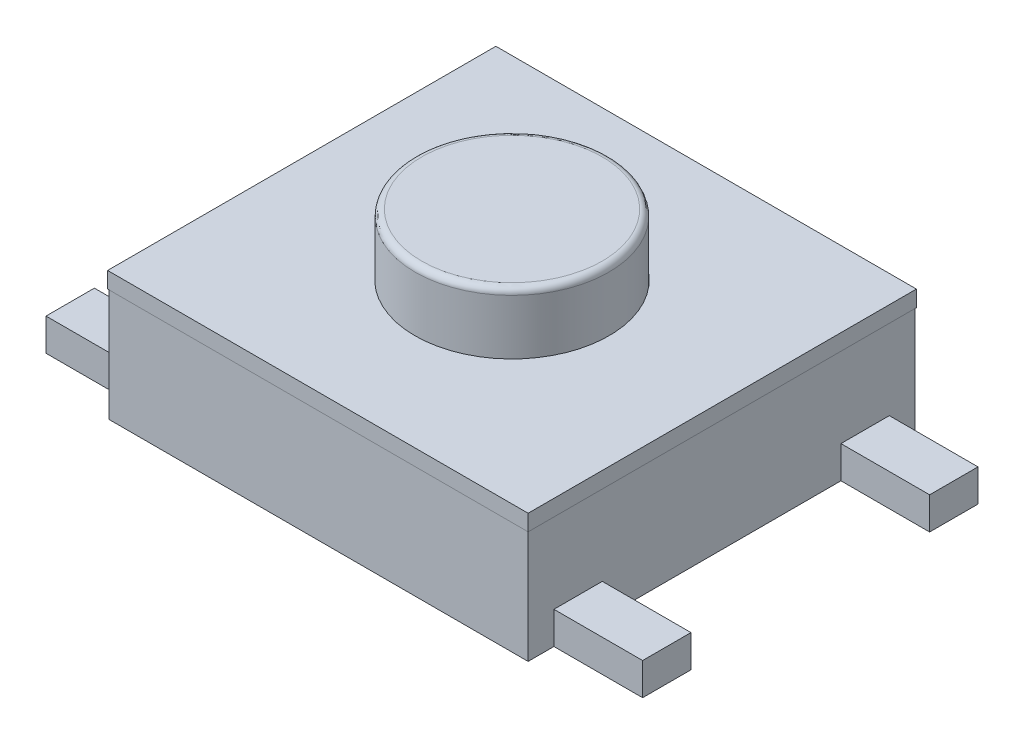
ISO-10303-21;
HEADER;
FILE_DESCRIPTION(('STEP AP214'),'2;1');
FILE_NAME('part.step','',(''),(''),'','','');
FILE_SCHEMA(('AUTOMOTIVE_DESIGN { 1 0 10303 214 1 1 1 1 }'));
ENDSEC;
DATA;
#1=APPLICATION_CONTEXT('core data for automotive mechanical design processes');
#2=APPLICATION_PROTOCOL_DEFINITION('international standard','automotive_design',2000,#1);
#3=PRODUCT_CONTEXT('',#1,'mechanical');
#4=PRODUCT('Part','Part','',(#3));
#5=PRODUCT_RELATED_PRODUCT_CATEGORY('part','',(#4));
#6=PRODUCT_DEFINITION_FORMATION('','',#4);
#7=PRODUCT_DEFINITION_CONTEXT('part definition',#1,'design');
#8=PRODUCT_DEFINITION('design','',#6,#7);
#9=PRODUCT_DEFINITION_SHAPE('','',#8);
#10=(LENGTH_UNIT() NAMED_UNIT(*) SI_UNIT(.MILLI.,.METRE.));
#11=(NAMED_UNIT(*) PLANE_ANGLE_UNIT() SI_UNIT($,.RADIAN.));
#12=(NAMED_UNIT(*) SI_UNIT($,.STERADIAN.) SOLID_ANGLE_UNIT());
#13=UNCERTAINTY_MEASURE_WITH_UNIT(LENGTH_MEASURE(1.E-05),#10,'distance_accuracy_value','');
#14=(GEOMETRIC_REPRESENTATION_CONTEXT(3) GLOBAL_UNCERTAINTY_ASSIGNED_CONTEXT((#13)) GLOBAL_UNIT_ASSIGNED_CONTEXT((#10,
#11,#12)) REPRESENTATION_CONTEXT('',''));
#15=CARTESIAN_POINT('',(0.,0.,0.));
#16=DIRECTION('',(0.,0.,1.));
#17=DIRECTION('',(1.,0.,0.));
#18=AXIS2_PLACEMENT_3D('',#15,#16,#17);
#19=CARTESIAN_POINT('',(-3.25,1.75,-3.));
#20=DIRECTION('',(1.,0.,0.));
#21=DIRECTION('',(0.,0.,-1.));
#22=AXIS2_PLACEMENT_3D('',#19,#20,#21);
#23=PLANE('',#22);
#24=DIRECTION('',(0.,0.,1.));
#25=VECTOR('',#24,1.);
#26=CARTESIAN_POINT('',(-3.25,0.,-3.));
#27=LINE('',#26,#25);
#28=CARTESIAN_POINT('',(-3.25,0.,-1.85));
#29=VERTEX_POINT('',#28);
#30=CARTESIAN_POINT('',(-3.25,0.,-0.375));
#31=VERTEX_POINT('',#30);
#32=EDGE_CURVE('E425',#29,#31,#27,.T.);
#33=ORIENTED_EDGE('',*,*,#32,.T.);
#34=DIRECTION('',(0.,-1.,0.));
#35=VECTOR('',#34,1.);
#36=CARTESIAN_POINT('',(-3.25,0.5,-0.375));
#37=LINE('',#36,#35);
#38=CARTESIAN_POINT('',(-3.25,0.5,-0.375));
#39=VERTEX_POINT('',#38);
#40=EDGE_CURVE('E52',#39,#31,#37,.T.);
#41=ORIENTED_EDGE('',*,*,#40,.F.);
#42=DIRECTION('',(0.,0.,1.));
#43=VECTOR('',#42,1.);
#44=CARTESIAN_POINT('',(-3.25,0.5,0.375));
#45=LINE('',#44,#43);
#46=CARTESIAN_POINT('',(-3.25,0.5,0.375));
#47=VERTEX_POINT('',#46);
#48=EDGE_CURVE('E47',#39,#47,#45,.T.);
#49=ORIENTED_EDGE('',*,*,#48,.T.);
#50=DIRECTION('',(0.,-1.,0.));
#51=VECTOR('',#50,1.);
#52=CARTESIAN_POINT('',(-3.25,0.5,0.375));
#53=LINE('',#52,#51);
#54=CARTESIAN_POINT('',(-3.25,0.,0.375));
#55=VERTEX_POINT('',#54);
#56=EDGE_CURVE('E228',#47,#55,#53,.T.);
#57=ORIENTED_EDGE('',*,*,#56,.T.);
#58=CARTESIAN_POINT('',(-3.25,0.,1.85));
#59=VERTEX_POINT('',#58);
#60=EDGE_CURVE('E426',#55,#59,#27,.T.);
#61=ORIENTED_EDGE('',*,*,#60,.T.);
#62=DIRECTION('',(0.,-1.,0.));
#63=VECTOR('',#62,1.);
#64=CARTESIAN_POINT('',(-3.25,0.5,1.85));
#65=LINE('',#64,#63);
#66=CARTESIAN_POINT('',(-3.25,0.5,1.85));
#67=VERTEX_POINT('',#66);
#68=EDGE_CURVE('E276',#67,#59,#65,.T.);
#69=ORIENTED_EDGE('',*,*,#68,.F.);
#70=DIRECTION('',(0.,0.,1.));
#71=VECTOR('',#70,1.);
#72=CARTESIAN_POINT('',(-3.25,0.5,2.6));
#73=LINE('',#72,#71);
#74=CARTESIAN_POINT('',(-3.25,0.5,2.6));
#75=VERTEX_POINT('',#74);
#76=EDGE_CURVE('E262',#67,#75,#73,.T.);
#77=ORIENTED_EDGE('',*,*,#76,.T.);
#78=DIRECTION('',(0.,-1.,0.));
#79=VECTOR('',#78,1.);
#80=CARTESIAN_POINT('',(-3.25,0.5,2.6));
#81=LINE('',#80,#79);
#82=CARTESIAN_POINT('',(-3.25,0.,2.6));
#83=VERTEX_POINT('',#82);
#84=EDGE_CURVE('E272',#75,#83,#81,.T.);
#85=ORIENTED_EDGE('',*,*,#84,.T.);
#86=CARTESIAN_POINT('',(-3.25,0.,3.));
#87=VERTEX_POINT('',#86);
#88=EDGE_CURVE('E407',#83,#87,#27,.T.);
#89=ORIENTED_EDGE('',*,*,#88,.T.);
#90=DIRECTION('',(0.,-1.,0.));
#91=VECTOR('',#90,1.);
#92=CARTESIAN_POINT('',(-3.25,1.75,3.));
#93=LINE('',#92,#91);
#94=CARTESIAN_POINT('',(-3.25,1.75,3.));
#95=VERTEX_POINT('',#94);
#96=EDGE_CURVE('E441',#95,#87,#93,.T.);
#97=ORIENTED_EDGE('',*,*,#96,.F.);
#98=DIRECTION('',(0.,0.,1.));
#99=VECTOR('',#98,1.);
#100=CARTESIAN_POINT('',(-3.25,1.75,-3.));
#101=LINE('',#100,#99);
#102=CARTESIAN_POINT('',(-3.25,1.75,-3.));
#103=VERTEX_POINT('',#102);
#104=EDGE_CURVE('E408',#103,#95,#101,.T.);
#105=ORIENTED_EDGE('',*,*,#104,.F.);
#106=DIRECTION('',(0.,-1.,0.));
#107=VECTOR('',#106,1.);
#108=CARTESIAN_POINT('',(-3.25,1.75,-3.));
#109=LINE('',#108,#107);
#110=CARTESIAN_POINT('',(-3.25,0.,-3.));
#111=VERTEX_POINT('',#110);
#112=EDGE_CURVE('E421',#103,#111,#109,.T.);
#113=ORIENTED_EDGE('',*,*,#112,.T.);
#114=CARTESIAN_POINT('',(-3.25,0.,-2.6));
#115=VERTEX_POINT('',#114);
#116=EDGE_CURVE('E422',#111,#115,#27,.T.);
#117=ORIENTED_EDGE('',*,*,#116,.T.);
#118=DIRECTION('',(0.,-1.,0.));
#119=VECTOR('',#118,1.);
#120=CARTESIAN_POINT('',(-3.25,0.5,-2.6));
#121=LINE('',#120,#119);
#122=CARTESIAN_POINT('',(-3.25,0.5,-2.6));
#123=VERTEX_POINT('',#122);
#124=EDGE_CURVE('E302',#123,#115,#121,.T.);
#125=ORIENTED_EDGE('',*,*,#124,.F.);
#126=DIRECTION('',(0.,0.,1.));
#127=VECTOR('',#126,1.);
#128=CARTESIAN_POINT('',(-3.25,0.5,-2.6));
#129=LINE('',#128,#127);
#130=CARTESIAN_POINT('',(-3.25,0.5,-1.85));
#131=VERTEX_POINT('',#130);
#132=EDGE_CURVE('E282',#123,#131,#129,.T.);
#133=ORIENTED_EDGE('',*,*,#132,.T.);
#134=DIRECTION('',(0.,-1.,0.));
#135=VECTOR('',#134,1.);
#136=CARTESIAN_POINT('',(-3.25,0.5,-1.85));
#137=LINE('',#136,#135);
#138=EDGE_CURVE('E294',#131,#29,#137,.T.);
#139=ORIENTED_EDGE('',*,*,#138,.T.);
#140=EDGE_LOOP('',(#33,#41,#49,#57,#61,#69,#77,#85,#89,#97,#105,#113,#117,#125,#133,#139));
#141=FACE_BOUND('',#140,.T.);
#142=ADVANCED_FACE('F32',(#141),#23,.F.);
#143=CARTESIAN_POINT('',(-3.25,1.75,3.));
#144=DIRECTION('',(0.,0.,-1.));
#145=DIRECTION('',(-1.,0.,0.));
#146=AXIS2_PLACEMENT_3D('',#143,#144,#145);
#147=PLANE('',#146);
#148=DIRECTION('',(1.,0.,0.));
#149=VECTOR('',#148,1.);
#150=CARTESIAN_POINT('',(-3.25,0.,3.));
#151=LINE('',#150,#149);
#152=CARTESIAN_POINT('',(3.25,0.,3.));
#153=VERTEX_POINT('',#152);
#154=EDGE_CURVE('E424',#87,#153,#151,.T.);
#155=ORIENTED_EDGE('',*,*,#154,.T.);
#156=DIRECTION('',(0.,-1.,0.));
#157=VECTOR('',#156,1.);
#158=CARTESIAN_POINT('',(3.25,1.75,3.));
#159=LINE('',#158,#157);
#160=CARTESIAN_POINT('',(3.25,1.75,3.));
#161=VERTEX_POINT('',#160);
#162=EDGE_CURVE('E438',#161,#153,#159,.T.);
#163=ORIENTED_EDGE('',*,*,#162,.F.);
#164=DIRECTION('',(1.,0.,0.));
#165=VECTOR('',#164,1.);
#166=CARTESIAN_POINT('',(-3.25,1.75,3.));
#167=LINE('',#166,#165);
#168=EDGE_CURVE('E411',#95,#161,#167,.T.);
#169=ORIENTED_EDGE('',*,*,#168,.F.);
#170=ORIENTED_EDGE('',*,*,#96,.T.);
#171=EDGE_LOOP('',(#155,#163,#169,#170));
#172=FACE_BOUND('',#171,.T.);
#173=ADVANCED_FACE('F465',(#172),#147,.F.);
#174=CARTESIAN_POINT('',(3.25,1.75,-3.));
#175=DIRECTION('',(-1.,0.,0.));
#176=DIRECTION('',(0.,0.,1.));
#177=AXIS2_PLACEMENT_3D('',#174,#175,#176);
#178=PLANE('',#177);
#179=DIRECTION('',(0.,0.,-1.));
#180=VECTOR('',#179,1.);
#181=CARTESIAN_POINT('',(3.25,0.5,-2.6));
#182=LINE('',#181,#180);
#183=CARTESIAN_POINT('',(3.25,0.5,-1.85));
#184=VERTEX_POINT('',#183);
#185=CARTESIAN_POINT('',(3.25,0.5,-2.6));
#186=VERTEX_POINT('',#185);
#187=EDGE_CURVE('E322',#184,#186,#182,.T.);
#188=ORIENTED_EDGE('',*,*,#187,.T.);
#189=DIRECTION('',(0.,-1.,0.));
#190=VECTOR('',#189,1.);
#191=CARTESIAN_POINT('',(3.25,0.5,-2.6));
#192=LINE('',#191,#190);
#193=CARTESIAN_POINT('',(3.25,0.,-2.6));
#194=VERTEX_POINT('',#193);
#195=EDGE_CURVE('E332',#186,#194,#192,.T.);
#196=ORIENTED_EDGE('',*,*,#195,.T.);
#197=DIRECTION('',(0.,0.,-1.));
#198=VECTOR('',#197,1.);
#199=CARTESIAN_POINT('',(3.25,0.,-3.));
#200=LINE('',#199,#198);
#201=CARTESIAN_POINT('',(3.25,0.,-3.));
#202=VERTEX_POINT('',#201);
#203=EDGE_CURVE('E428',#194,#202,#200,.T.);
#204=ORIENTED_EDGE('',*,*,#203,.T.);
#205=DIRECTION('',(0.,-1.,0.));
#206=VECTOR('',#205,1.);
#207=CARTESIAN_POINT('',(3.25,1.75,-3.));
#208=LINE('',#207,#206);
#209=CARTESIAN_POINT('',(3.25,1.75,-3.));
#210=VERTEX_POINT('',#209);
#211=EDGE_CURVE('E435',#210,#202,#208,.T.);
#212=ORIENTED_EDGE('',*,*,#211,.F.);
#213=DIRECTION('',(0.,0.,-1.));
#214=VECTOR('',#213,1.);
#215=CARTESIAN_POINT('',(3.25,1.75,-3.));
#216=LINE('',#215,#214);
#217=EDGE_CURVE('E415',#161,#210,#216,.T.);
#218=ORIENTED_EDGE('',*,*,#217,.F.);
#219=ORIENTED_EDGE('',*,*,#162,.T.);
#220=CARTESIAN_POINT('',(3.25,0.,2.6));
#221=VERTEX_POINT('',#220);
#222=EDGE_CURVE('E429',#153,#221,#200,.T.);
#223=ORIENTED_EDGE('',*,*,#222,.T.);
#224=DIRECTION('',(0.,-1.,0.));
#225=VECTOR('',#224,1.);
#226=CARTESIAN_POINT('',(3.25,0.5,2.6));
#227=LINE('',#226,#225);
#228=CARTESIAN_POINT('',(3.25,0.5,2.6));
#229=VERTEX_POINT('',#228);
#230=EDGE_CURVE('E362',#229,#221,#227,.T.);
#231=ORIENTED_EDGE('',*,*,#230,.F.);
#232=DIRECTION('',(0.,0.,-1.));
#233=VECTOR('',#232,1.);
#234=CARTESIAN_POINT('',(3.25,0.5,2.6));
#235=LINE('',#234,#233);
#236=CARTESIAN_POINT('',(3.25,0.5,1.85));
#237=VERTEX_POINT('',#236);
#238=EDGE_CURVE('E342',#229,#237,#235,.T.);
#239=ORIENTED_EDGE('',*,*,#238,.T.);
#240=DIRECTION('',(0.,-1.,0.));
#241=VECTOR('',#240,1.);
#242=CARTESIAN_POINT('',(3.25,0.5,1.85));
#243=LINE('',#242,#241);
#244=CARTESIAN_POINT('',(3.25,0.,1.85));
#245=VERTEX_POINT('',#244);
#246=EDGE_CURVE('E354',#237,#245,#243,.T.);
#247=ORIENTED_EDGE('',*,*,#246,.T.);
#248=CARTESIAN_POINT('',(3.25,0.,-1.85));
#249=VERTEX_POINT('',#248);
#250=EDGE_CURVE('E431',#245,#249,#200,.T.);
#251=ORIENTED_EDGE('',*,*,#250,.T.);
#252=DIRECTION('',(0.,-1.,0.));
#253=VECTOR('',#252,1.);
#254=CARTESIAN_POINT('',(3.25,0.5,-1.85));
#255=LINE('',#254,#253);
#256=EDGE_CURVE('E336',#184,#249,#255,.T.);
#257=ORIENTED_EDGE('',*,*,#256,.F.);
#258=EDGE_LOOP('',(#188,#196,#204,#212,#218,#219,#223,#231,#239,#247,#251,#257));
#259=FACE_BOUND('',#258,.T.);
#260=ADVANCED_FACE('F469',(#259),#178,.F.);
#261=CARTESIAN_POINT('',(-3.25,1.75,-3.));
#262=DIRECTION('',(0.,0.,1.));
#263=DIRECTION('',(1.,0.,0.));
#264=AXIS2_PLACEMENT_3D('',#261,#262,#263);
#265=PLANE('',#264);
#266=DIRECTION('',(-1.,0.,0.));
#267=VECTOR('',#266,1.);
#268=CARTESIAN_POINT('',(-3.25,0.,-3.));
#269=LINE('',#268,#267);
#270=EDGE_CURVE('E412',#202,#111,#269,.T.);
#271=ORIENTED_EDGE('',*,*,#270,.T.);
#272=ORIENTED_EDGE('',*,*,#112,.F.);
#273=DIRECTION('',(-1.,0.,0.));
#274=VECTOR('',#273,1.);
#275=CARTESIAN_POINT('',(-3.25,1.75,-3.));
#276=LINE('',#275,#274);
#277=EDGE_CURVE('E418',#210,#103,#276,.T.);
#278=ORIENTED_EDGE('',*,*,#277,.F.);
#279=ORIENTED_EDGE('',*,*,#211,.T.);
#280=EDGE_LOOP('',(#271,#272,#278,#279));
#281=FACE_BOUND('',#280,.T.);
#282=ADVANCED_FACE('F475',(#281),#265,.F.);
#283=CARTESIAN_POINT('',(0.,0.,0.));
#284=DIRECTION('',(0.,1.,0.));
#285=DIRECTION('',(0.,0.,1.));
#286=AXIS2_PLACEMENT_3D('',#283,#284,#285);
#287=PLANE('',#286);
#288=ORIENTED_EDGE('',*,*,#116,.F.);
#289=ORIENTED_EDGE('',*,*,#270,.F.);
#290=ORIENTED_EDGE('',*,*,#203,.F.);
#291=DIRECTION('',(1.,0.,0.));
#292=VECTOR('',#291,1.);
#293=CARTESIAN_POINT('',(3.25,0.,-2.6));
#294=LINE('',#293,#292);
#295=CARTESIAN_POINT('',(4.625,0.,-2.6));
#296=VERTEX_POINT('',#295);
#297=EDGE_CURVE('E305',#194,#296,#294,.T.);
#298=ORIENTED_EDGE('',*,*,#297,.T.);
#299=DIRECTION('',(0.,0.,1.));
#300=VECTOR('',#299,1.);
#301=CARTESIAN_POINT('',(4.625,0.,-2.6));
#302=LINE('',#301,#300);
#303=CARTESIAN_POINT('',(4.625,0.,-1.85));
#304=VERTEX_POINT('',#303);
#305=EDGE_CURVE('E327',#296,#304,#302,.T.);
#306=ORIENTED_EDGE('',*,*,#305,.T.);
#307=DIRECTION('',(-1.,0.,0.));
#308=VECTOR('',#307,1.);
#309=CARTESIAN_POINT('',(3.25,0.,-1.85));
#310=LINE('',#309,#308);
#311=EDGE_CURVE('E316',#304,#249,#310,.T.);
#312=ORIENTED_EDGE('',*,*,#311,.T.);
#313=ORIENTED_EDGE('',*,*,#250,.F.);
#314=DIRECTION('',(1.,0.,0.));
#315=VECTOR('',#314,1.);
#316=CARTESIAN_POINT('',(3.25,0.,1.85));
#317=LINE('',#316,#315);
#318=CARTESIAN_POINT('',(4.625,0.,1.85));
#319=VERTEX_POINT('',#318);
#320=EDGE_CURVE('E335',#245,#319,#317,.T.);
#321=ORIENTED_EDGE('',*,*,#320,.T.);
#322=DIRECTION('',(0.,0.,1.));
#323=VECTOR('',#322,1.);
#324=CARTESIAN_POINT('',(4.625,0.,2.6));
#325=LINE('',#324,#323);
#326=CARTESIAN_POINT('',(4.625,0.,2.6));
#327=VERTEX_POINT('',#326);
#328=EDGE_CURVE('E357',#319,#327,#325,.T.);
#329=ORIENTED_EDGE('',*,*,#328,.T.);
#330=DIRECTION('',(-1.,0.,0.));
#331=VECTOR('',#330,1.);
#332=CARTESIAN_POINT('',(3.25,0.,2.6));
#333=LINE('',#332,#331);
#334=EDGE_CURVE('E345',#327,#221,#333,.T.);
#335=ORIENTED_EDGE('',*,*,#334,.T.);
#336=ORIENTED_EDGE('',*,*,#222,.F.);
#337=ORIENTED_EDGE('',*,*,#154,.F.);
#338=ORIENTED_EDGE('',*,*,#88,.F.);
#339=DIRECTION('',(-1.,0.,0.));
#340=VECTOR('',#339,1.);
#341=CARTESIAN_POINT('',(-3.25,0.,2.6));
#342=LINE('',#341,#340);
#343=CARTESIAN_POINT('',(-4.625,0.,2.6));
#344=VERTEX_POINT('',#343);
#345=EDGE_CURVE('E249',#83,#344,#342,.T.);
#346=ORIENTED_EDGE('',*,*,#345,.T.);
#347=DIRECTION('',(0.,0.,-1.));
#348=VECTOR('',#347,1.);
#349=CARTESIAN_POINT('',(-4.625,0.,2.6));
#350=LINE('',#349,#348);
#351=CARTESIAN_POINT('',(-4.625,0.,1.85));
#352=VERTEX_POINT('',#351);
#353=EDGE_CURVE('E267',#344,#352,#350,.T.);
#354=ORIENTED_EDGE('',*,*,#353,.T.);
#355=DIRECTION('',(1.,0.,0.));
#356=VECTOR('',#355,1.);
#357=CARTESIAN_POINT('',(-3.25,0.,1.85));
#358=LINE('',#357,#356);
#359=EDGE_CURVE('E256',#352,#59,#358,.T.);
#360=ORIENTED_EDGE('',*,*,#359,.T.);
#361=ORIENTED_EDGE('',*,*,#60,.F.);
#362=DIRECTION('',(-1.,0.,0.));
#363=VECTOR('',#362,1.);
#364=CARTESIAN_POINT('',(-3.25,0.,0.375));
#365=LINE('',#364,#363);
#366=CARTESIAN_POINT('',(-4.625,0.,0.375));
#367=VERTEX_POINT('',#366);
#368=EDGE_CURVE('E243',#55,#367,#365,.T.);
#369=ORIENTED_EDGE('',*,*,#368,.T.);
#370=DIRECTION('',(0.,0.,-1.));
#371=VECTOR('',#370,1.);
#372=CARTESIAN_POINT('',(-4.625,0.,0.375));
#373=LINE('',#372,#371);
#374=CARTESIAN_POINT('',(-4.625,0.,-0.375));
#375=VERTEX_POINT('',#374);
#376=EDGE_CURVE('E222',#367,#375,#373,.T.);
#377=ORIENTED_EDGE('',*,*,#376,.T.);
#378=DIRECTION('',(1.,0.,0.));
#379=VECTOR('',#378,1.);
#380=CARTESIAN_POINT('',(-3.25,0.,-0.375));
#381=LINE('',#380,#379);
#382=EDGE_CURVE('E239',#375,#31,#381,.T.);
#383=ORIENTED_EDGE('',*,*,#382,.T.);
#384=ORIENTED_EDGE('',*,*,#32,.F.);
#385=DIRECTION('',(-1.,0.,0.));
#386=VECTOR('',#385,1.);
#387=CARTESIAN_POINT('',(-3.25,0.,-1.85));
#388=LINE('',#387,#386);
#389=CARTESIAN_POINT('',(-4.625,0.,-1.85));
#390=VERTEX_POINT('',#389);
#391=EDGE_CURVE('E275',#29,#390,#388,.T.);
#392=ORIENTED_EDGE('',*,*,#391,.T.);
#393=DIRECTION('',(0.,0.,-1.));
#394=VECTOR('',#393,1.);
#395=CARTESIAN_POINT('',(-4.625,0.,-2.6));
#396=LINE('',#395,#394);
#397=CARTESIAN_POINT('',(-4.625,0.,-2.6));
#398=VERTEX_POINT('',#397);
#399=EDGE_CURVE('E297',#390,#398,#396,.T.);
#400=ORIENTED_EDGE('',*,*,#399,.T.);
#401=DIRECTION('',(1.,0.,0.));
#402=VECTOR('',#401,1.);
#403=CARTESIAN_POINT('',(-3.25,0.,-2.6));
#404=LINE('',#403,#402);
#405=EDGE_CURVE('E285',#398,#115,#404,.T.);
#406=ORIENTED_EDGE('',*,*,#405,.T.);
#407=EDGE_LOOP('',(#288,#289,#290,#298,#306,#312,#313,#321,#329,#335,#336,#337,#338,#346,#354,
#360,#361,#369,#377,#383,#384,#392,#400,#406));
#408=FACE_BOUND('',#407,.T.);
#409=ADVANCED_FACE('F479',(#408),#287,.F.);
#410=CARTESIAN_POINT('',(0.,1.75,0.));
#411=DIRECTION('',(0.,1.,0.));
#412=DIRECTION('',(0.,0.,1.));
#413=AXIS2_PLACEMENT_3D('',#410,#411,#412);
#414=PLANE('',#413);
#415=DIRECTION('',(-1.,0.,0.));
#416=VECTOR('',#415,1.);
#417=CARTESIAN_POINT('',(3.26,1.75,-3.01));
#418=LINE('',#417,#416);
#419=CARTESIAN_POINT('',(3.26,1.75,-3.01));
#420=VERTEX_POINT('',#419);
#421=CARTESIAN_POINT('',(-3.26,1.75,-3.01));
#422=VERTEX_POINT('',#421);
#423=EDGE_CURVE('E377',#420,#422,#418,.T.);
#424=ORIENTED_EDGE('',*,*,#423,.F.);
#425=DIRECTION('',(0.,0.,-1.));
#426=VECTOR('',#425,1.);
#427=CARTESIAN_POINT('',(3.26,1.75,3.01));
#428=LINE('',#427,#426);
#429=CARTESIAN_POINT('',(3.26,1.75,3.01));
#430=VERTEX_POINT('',#429);
#431=EDGE_CURVE('E382',#430,#420,#428,.T.);
#432=ORIENTED_EDGE('',*,*,#431,.F.);
#433=DIRECTION('',(1.,0.,0.));
#434=VECTOR('',#433,1.);
#435=CARTESIAN_POINT('',(-3.26,1.75,3.01));
#436=LINE('',#435,#434);
#437=CARTESIAN_POINT('',(-3.26,1.75,3.01));
#438=VERTEX_POINT('',#437);
#439=EDGE_CURVE('E393',#438,#430,#436,.T.);
#440=ORIENTED_EDGE('',*,*,#439,.F.);
#441=DIRECTION('',(0.,0.,1.));
#442=VECTOR('',#441,1.);
#443=CARTESIAN_POINT('',(-3.26,1.75,-3.01));
#444=LINE('',#443,#442);
#445=EDGE_CURVE('E391',#422,#438,#444,.T.);
#446=ORIENTED_EDGE('',*,*,#445,.F.);
#447=EDGE_LOOP('',(#424,#432,#440,#446));
#448=FACE_BOUND('',#447,.T.);
#449=ORIENTED_EDGE('',*,*,#277,.T.);
#450=ORIENTED_EDGE('',*,*,#104,.T.);
#451=ORIENTED_EDGE('',*,*,#168,.T.);
#452=ORIENTED_EDGE('',*,*,#217,.T.);
#453=EDGE_LOOP('',(#449,#450,#451,#452));
#454=FACE_BOUND('',#453,.T.);
#455=ADVANCED_FACE('F483',(#448,#454),#414,.F.);
#456=CARTESIAN_POINT('',(0.,2.,0.));
#457=DIRECTION('',(0.,1.,0.));
#458=DIRECTION('',(0.,0.,1.));
#459=AXIS2_PLACEMENT_3D('',#456,#457,#458);
#460=PLANE('',#459);
#461=DIRECTION('',(-1.,0.,0.));
#462=VECTOR('',#461,1.);
#463=CARTESIAN_POINT('',(3.26,2.,-3.01));
#464=LINE('',#463,#462);
#465=CARTESIAN_POINT('',(3.26,2.,-3.01));
#466=VERTEX_POINT('',#465);
#467=CARTESIAN_POINT('',(-3.26,2.,-3.01));
#468=VERTEX_POINT('',#467);
#469=EDGE_CURVE('E378',#466,#468,#464,.T.);
#470=ORIENTED_EDGE('',*,*,#469,.T.);
#471=DIRECTION('',(0.,0.,1.));
#472=VECTOR('',#471,1.);
#473=CARTESIAN_POINT('',(-3.26,2.,-3.01));
#474=LINE('',#473,#472);
#475=CARTESIAN_POINT('',(-3.26,2.,3.01));
#476=VERTEX_POINT('',#475);
#477=EDGE_CURVE('E381',#468,#476,#474,.T.);
#478=ORIENTED_EDGE('',*,*,#477,.T.);
#479=DIRECTION('',(1.,0.,0.));
#480=VECTOR('',#479,1.);
#481=CARTESIAN_POINT('',(-3.26,2.,3.01));
#482=LINE('',#481,#480);
#483=CARTESIAN_POINT('',(3.26,2.,3.01));
#484=VERTEX_POINT('',#483);
#485=EDGE_CURVE('E384',#476,#484,#482,.T.);
#486=ORIENTED_EDGE('',*,*,#485,.T.);
#487=DIRECTION('',(0.,0.,-1.));
#488=VECTOR('',#487,1.);
#489=CARTESIAN_POINT('',(3.26,2.,3.01));
#490=LINE('',#489,#488);
#491=EDGE_CURVE('E386',#484,#466,#490,.T.);
#492=ORIENTED_EDGE('',*,*,#491,.T.);
#493=EDGE_LOOP('',(#470,#478,#486,#492));
#494=FACE_BOUND('',#493,.T.);
#495=CARTESIAN_POINT('',(0.,2.,0.));
#496=DIRECTION('',(0.,1.,0.));
#497=DIRECTION('',(0.,0.,1.));
#498=AXIS2_PLACEMENT_3D('',#495,#496,#497);
#499=CIRCLE('',#498,1.505);
#500=CARTESIAN_POINT('',(0.,2.,1.505));
#501=VERTEX_POINT('',#500);
#502=EDGE_CURVE('E374',#501,#501,#499,.T.);
#503=ORIENTED_EDGE('',*,*,#502,.F.);
#504=EDGE_LOOP('',(#503));
#505=FACE_BOUND('',#504,.T.);
#506=ADVANCED_FACE('F494',(#494,#505),#460,.T.);
#507=CARTESIAN_POINT('',(3.26,2.,-3.01));
#508=DIRECTION('',(0.,0.,1.));
#509=DIRECTION('',(1.,0.,0.));
#510=AXIS2_PLACEMENT_3D('',#507,#508,#509);
#511=PLANE('',#510);
#512=ORIENTED_EDGE('',*,*,#423,.T.);
#513=DIRECTION('',(0.,-1.,0.));
#514=VECTOR('',#513,1.);
#515=CARTESIAN_POINT('',(-3.26,2.,-3.01));
#516=LINE('',#515,#514);
#517=EDGE_CURVE('E404',#468,#422,#516,.T.);
#518=ORIENTED_EDGE('',*,*,#517,.F.);
#519=ORIENTED_EDGE('',*,*,#469,.F.);
#520=DIRECTION('',(0.,-1.,0.));
#521=VECTOR('',#520,1.);
#522=CARTESIAN_POINT('',(3.26,2.,-3.01));
#523=LINE('',#522,#521);
#524=EDGE_CURVE('E388',#466,#420,#523,.T.);
#525=ORIENTED_EDGE('',*,*,#524,.T.);
#526=EDGE_LOOP('',(#512,#518,#519,#525));
#527=FACE_BOUND('',#526,.T.);
#528=ADVANCED_FACE('F490',(#527),#511,.F.);
#529=CARTESIAN_POINT('',(-3.26,2.,-3.01));
#530=DIRECTION('',(1.,0.,0.));
#531=DIRECTION('',(0.,0.,-1.));
#532=AXIS2_PLACEMENT_3D('',#529,#530,#531);
#533=PLANE('',#532);
#534=ORIENTED_EDGE('',*,*,#445,.T.);
#535=DIRECTION('',(0.,-1.,0.));
#536=VECTOR('',#535,1.);
#537=CARTESIAN_POINT('',(-3.26,2.,3.01));
#538=LINE('',#537,#536);
#539=EDGE_CURVE('E401',#476,#438,#538,.T.);
#540=ORIENTED_EDGE('',*,*,#539,.F.);
#541=ORIENTED_EDGE('',*,*,#477,.F.);
#542=ORIENTED_EDGE('',*,*,#517,.T.);
#543=EDGE_LOOP('',(#534,#540,#541,#542));
#544=FACE_BOUND('',#543,.T.);
#545=ADVANCED_FACE('F493',(#544),#533,.F.);
#546=CARTESIAN_POINT('',(-3.26,2.,3.01));
#547=DIRECTION('',(0.,0.,-1.));
#548=DIRECTION('',(-1.,0.,0.));
#549=AXIS2_PLACEMENT_3D('',#546,#547,#548);
#550=PLANE('',#549);
#551=ORIENTED_EDGE('',*,*,#439,.T.);
#552=DIRECTION('',(0.,-1.,0.));
#553=VECTOR('',#552,1.);
#554=CARTESIAN_POINT('',(3.26,2.,3.01));
#555=LINE('',#554,#553);
#556=EDGE_CURVE('E398',#484,#430,#555,.T.);
#557=ORIENTED_EDGE('',*,*,#556,.F.);
#558=ORIENTED_EDGE('',*,*,#485,.F.);
#559=ORIENTED_EDGE('',*,*,#539,.T.);
#560=EDGE_LOOP('',(#551,#557,#558,#559));
#561=FACE_BOUND('',#560,.T.);
#562=ADVANCED_FACE('F498',(#561),#550,.F.);
#563=CARTESIAN_POINT('',(3.26,2.,3.01));
#564=DIRECTION('',(-1.,0.,0.));
#565=DIRECTION('',(0.,0.,1.));
#566=AXIS2_PLACEMENT_3D('',#563,#564,#565);
#567=PLANE('',#566);
#568=ORIENTED_EDGE('',*,*,#431,.T.);
#569=ORIENTED_EDGE('',*,*,#524,.F.);
#570=ORIENTED_EDGE('',*,*,#491,.F.);
#571=ORIENTED_EDGE('',*,*,#556,.T.);
#572=EDGE_LOOP('',(#568,#569,#570,#571));
#573=FACE_BOUND('',#572,.T.);
#574=ADVANCED_FACE('F502',(#573),#567,.F.);
#575=CARTESIAN_POINT('',(0.,2.,0.));
#576=DIRECTION('',(0.,-1.,0.));
#577=DIRECTION('',(0.,0.,-1.));
#578=AXIS2_PLACEMENT_3D('',#575,#576,#577);
#579=CYLINDRICAL_SURFACE('',#578,1.505);
#580=ORIENTED_EDGE('',*,*,#502,.T.);
#581=EDGE_LOOP('',(#580));
#582=FACE_BOUND('',#581,.T.);
#583=CARTESIAN_POINT('',(0.,1.75,0.));
#584=DIRECTION('',(0.,1.,0.));
#585=DIRECTION('',(0.,0.,1.));
#586=AXIS2_PLACEMENT_3D('',#583,#584,#585);
#587=CIRCLE('',#586,1.505);
#588=CARTESIAN_POINT('',(0.,1.75,1.505));
#589=VERTEX_POINT('',#588);
#590=EDGE_CURVE('E444',#589,#589,#587,.F.);
#591=ORIENTED_EDGE('',*,*,#590,.T.);
#592=EDGE_LOOP('',(#591));
#593=FACE_BOUND('',#592,.T.);
#594=ADVANCED_FACE('F488',(#582,#593),#579,.F.);
#595=CARTESIAN_POINT('',(0.,1.75,0.));
#596=DIRECTION('',(0.,1.,0.));
#597=DIRECTION('',(0.,0.,1.));
#598=AXIS2_PLACEMENT_3D('',#595,#596,#597);
#599=PLANE('',#598);
#600=CARTESIAN_POINT('',(0.,1.75,0.));
#601=DIRECTION('',(0.,1.,0.));
#602=DIRECTION('',(0.,0.,1.));
#603=AXIS2_PLACEMENT_3D('',#600,#601,#602);
#604=CIRCLE('',#603,1.5);
#605=CARTESIAN_POINT('',(0.,1.75,1.5));
#606=VERTEX_POINT('',#605);
#607=EDGE_CURVE('E365',#606,#606,#604,.T.);
#608=ORIENTED_EDGE('',*,*,#607,.F.);
#609=EDGE_LOOP('',(#608));
#610=FACE_BOUND('',#609,.T.);
#611=ORIENTED_EDGE('',*,*,#590,.F.);
#612=EDGE_LOOP('',(#611));
#613=FACE_BOUND('',#612,.T.);
#614=ADVANCED_FACE('F485',(#610,#613),#599,.T.);
#615=CARTESIAN_POINT('',(0.,2.95,0.));
#616=DIRECTION('',(0.,-1.,0.));
#617=DIRECTION('',(0.,0.,-1.));
#618=AXIS2_PLACEMENT_3D('',#615,#616,#617);
#619=CYLINDRICAL_SURFACE('',#618,1.5);
#620=CARTESIAN_POINT('',(0.,2.85,0.));
#621=DIRECTION('',(0.,1.,0.));
#622=DIRECTION('',(0.,0.,1.));
#623=AXIS2_PLACEMENT_3D('',#620,#621,#622);
#624=CIRCLE('',#623,1.5);
#625=CARTESIAN_POINT('',(0.,2.85,1.5));
#626=VERTEX_POINT('',#625);
#627=EDGE_CURVE('E11',#626,#626,#624,.F.);
#628=ORIENTED_EDGE('',*,*,#627,.T.);
#629=EDGE_LOOP('',(#628));
#630=FACE_BOUND('',#629,.T.);
#631=ORIENTED_EDGE('',*,*,#607,.T.);
#632=EDGE_LOOP('',(#631));
#633=FACE_BOUND('',#632,.T.);
#634=ADVANCED_FACE('F461',(#630,#633),#619,.T.);
#635=CARTESIAN_POINT('',(0.,2.95,0.));
#636=DIRECTION('',(0.,1.,0.));
#637=DIRECTION('',(0.,0.,1.));
#638=AXIS2_PLACEMENT_3D('',#635,#636,#637);
#639=PLANE('',#638);
#640=CARTESIAN_POINT('',(0.,2.95,0.));
#641=DIRECTION('',(0.,1.,0.));
#642=DIRECTION('',(0.,0.,1.));
#643=AXIS2_PLACEMENT_3D('',#640,#641,#642);
#644=CIRCLE('',#643,1.4);
#645=CARTESIAN_POINT('',(0.,2.95,1.4));
#646=VERTEX_POINT('',#645);
#647=EDGE_CURVE('E40',#646,#646,#644,.T.);
#648=ORIENTED_EDGE('',*,*,#647,.T.);
#649=EDGE_LOOP('',(#648));
#650=FACE_BOUND('',#649,.T.);
#651=ADVANCED_FACE('F449',(#650),#639,.T.);
#652=CARTESIAN_POINT('',(0.,2.85,0.));
#653=DIRECTION('',(0.,1.,0.));
#654=DIRECTION('',(0.,0.,1.));
#655=AXIS2_PLACEMENT_3D('',#652,#653,#654);
#656=TOROIDAL_SURFACE('',#655,1.4,0.1);
#657=ORIENTED_EDGE('',*,*,#627,.F.);
#658=EDGE_LOOP('',(#657));
#659=FACE_BOUND('',#658,.T.);
#660=ORIENTED_EDGE('',*,*,#647,.F.);
#661=EDGE_LOOP('',(#660));
#662=FACE_BOUND('',#661,.T.);
#663=ADVANCED_FACE('F34',(#659,#662),#656,.T.);
#664=CARTESIAN_POINT('',(3.25,0.5,2.6));
#665=DIRECTION('',(0.,0.,1.));
#666=DIRECTION('',(1.,0.,0.));
#667=AXIS2_PLACEMENT_3D('',#664,#665,#666);
#668=PLANE('',#667);
#669=ORIENTED_EDGE('',*,*,#334,.F.);
#670=DIRECTION('',(0.,-1.,0.));
#671=VECTOR('',#670,1.);
#672=CARTESIAN_POINT('',(4.625,0.5,2.6));
#673=LINE('',#672,#671);
#674=CARTESIAN_POINT('',(4.625,0.5,2.6));
#675=VERTEX_POINT('',#674);
#676=EDGE_CURVE('E366',#675,#327,#673,.T.);
#677=ORIENTED_EDGE('',*,*,#676,.F.);
#678=DIRECTION('',(-1.,0.,0.));
#679=VECTOR('',#678,1.);
#680=CARTESIAN_POINT('',(3.25,0.5,2.6));
#681=LINE('',#680,#679);
#682=EDGE_CURVE('E351',#675,#229,#681,.T.);
#683=ORIENTED_EDGE('',*,*,#682,.T.);
#684=ORIENTED_EDGE('',*,*,#230,.T.);
#685=EDGE_LOOP('',(#669,#677,#683,#684));
#686=FACE_BOUND('',#685,.T.);
#687=ADVANCED_FACE('F452',(#686),#668,.T.);
#688=CARTESIAN_POINT('',(4.625,0.5,2.6));
#689=DIRECTION('',(1.,0.,0.));
#690=DIRECTION('',(0.,0.,-1.));
#691=AXIS2_PLACEMENT_3D('',#688,#689,#690);
#692=PLANE('',#691);
#693=ORIENTED_EDGE('',*,*,#328,.F.);
#694=DIRECTION('',(0.,-1.,0.));
#695=VECTOR('',#694,1.);
#696=CARTESIAN_POINT('',(4.625,0.5,1.85));
#697=LINE('',#696,#695);
#698=CARTESIAN_POINT('',(4.625,0.5,1.85));
#699=VERTEX_POINT('',#698);
#700=EDGE_CURVE('E368',#699,#319,#697,.T.);
#701=ORIENTED_EDGE('',*,*,#700,.F.);
#702=DIRECTION('',(0.,0.,1.));
#703=VECTOR('',#702,1.);
#704=CARTESIAN_POINT('',(4.625,0.5,2.6));
#705=LINE('',#704,#703);
#706=EDGE_CURVE('E348',#699,#675,#705,.T.);
#707=ORIENTED_EDGE('',*,*,#706,.T.);
#708=ORIENTED_EDGE('',*,*,#676,.T.);
#709=EDGE_LOOP('',(#693,#701,#707,#708));
#710=FACE_BOUND('',#709,.T.);
#711=ADVANCED_FACE('F458',(#710),#692,.T.);
#712=CARTESIAN_POINT('',(3.25,0.5,1.85));
#713=DIRECTION('',(0.,0.,-1.));
#714=DIRECTION('',(-1.,0.,0.));
#715=AXIS2_PLACEMENT_3D('',#712,#713,#714);
#716=PLANE('',#715);
#717=ORIENTED_EDGE('',*,*,#320,.F.);
#718=ORIENTED_EDGE('',*,*,#246,.F.);
#719=DIRECTION('',(1.,0.,0.));
#720=VECTOR('',#719,1.);
#721=CARTESIAN_POINT('',(3.25,0.5,1.85));
#722=LINE('',#721,#720);
#723=EDGE_CURVE('E344',#237,#699,#722,.T.);
#724=ORIENTED_EDGE('',*,*,#723,.T.);
#725=ORIENTED_EDGE('',*,*,#700,.T.);
#726=EDGE_LOOP('',(#717,#718,#724,#725));
#727=FACE_BOUND('',#726,.T.);
#728=ADVANCED_FACE('F519',(#727),#716,.T.);
#729=CARTESIAN_POINT('',(0.,0.5,0.));
#730=DIRECTION('',(0.,-1.,0.));
#731=DIRECTION('',(0.,0.,-1.));
#732=AXIS2_PLACEMENT_3D('',#729,#730,#731);
#733=PLANE('',#732);
#734=ORIENTED_EDGE('',*,*,#238,.F.);
#735=ORIENTED_EDGE('',*,*,#682,.F.);
#736=ORIENTED_EDGE('',*,*,#706,.F.);
#737=ORIENTED_EDGE('',*,*,#723,.F.);
#738=EDGE_LOOP('',(#734,#735,#736,#737));
#739=FACE_BOUND('',#738,.T.);
#740=ADVANCED_FACE('F522',(#739),#733,.F.);
#741=CARTESIAN_POINT('',(3.25,0.5,-2.6));
#742=DIRECTION('',(0.,0.,-1.));
#743=DIRECTION('',(-1.,0.,0.));
#744=AXIS2_PLACEMENT_3D('',#741,#742,#743);
#745=PLANE('',#744);
#746=ORIENTED_EDGE('',*,*,#297,.F.);
#747=ORIENTED_EDGE('',*,*,#195,.F.);
#748=DIRECTION('',(1.,0.,0.));
#749=VECTOR('',#748,1.);
#750=CARTESIAN_POINT('',(3.25,0.5,-2.6));
#751=LINE('',#750,#749);
#752=CARTESIAN_POINT('',(4.625,0.5,-2.6));
#753=VERTEX_POINT('',#752);
#754=EDGE_CURVE('E312',#186,#753,#751,.T.);
#755=ORIENTED_EDGE('',*,*,#754,.T.);
#756=DIRECTION('',(0.,-1.,0.));
#757=VECTOR('',#756,1.);
#758=CARTESIAN_POINT('',(4.625,0.5,-2.6));
#759=LINE('',#758,#757);
#760=EDGE_CURVE('E324',#753,#296,#759,.T.);
#761=ORIENTED_EDGE('',*,*,#760,.T.);
#762=EDGE_LOOP('',(#746,#747,#755,#761));
#763=FACE_BOUND('',#762,.T.);
#764=ADVANCED_FACE('F529',(#763),#745,.T.);
#765=CARTESIAN_POINT('',(3.25,0.5,-1.85));
#766=DIRECTION('',(0.,0.,1.));
#767=DIRECTION('',(1.,0.,0.));
#768=AXIS2_PLACEMENT_3D('',#765,#766,#767);
#769=PLANE('',#768);
#770=ORIENTED_EDGE('',*,*,#311,.F.);
#771=DIRECTION('',(0.,-1.,0.));
#772=VECTOR('',#771,1.);
#773=CARTESIAN_POINT('',(4.625,0.5,-1.85));
#774=LINE('',#773,#772);
#775=CARTESIAN_POINT('',(4.625,0.5,-1.85));
#776=VERTEX_POINT('',#775);
#777=EDGE_CURVE('E339',#776,#304,#774,.T.);
#778=ORIENTED_EDGE('',*,*,#777,.F.);
#779=DIRECTION('',(-1.,0.,0.));
#780=VECTOR('',#779,1.);
#781=CARTESIAN_POINT('',(3.25,0.5,-1.85));
#782=LINE('',#781,#780);
#783=EDGE_CURVE('E319',#776,#184,#782,.T.);
#784=ORIENTED_EDGE('',*,*,#783,.T.);
#785=ORIENTED_EDGE('',*,*,#256,.T.);
#786=EDGE_LOOP('',(#770,#778,#784,#785));
#787=FACE_BOUND('',#786,.T.);
#788=ADVANCED_FACE('F533',(#787),#769,.T.);
#789=CARTESIAN_POINT('',(4.625,0.5,-2.6));
#790=DIRECTION('',(1.,0.,0.));
#791=DIRECTION('',(0.,0.,-1.));
#792=AXIS2_PLACEMENT_3D('',#789,#790,#791);
#793=PLANE('',#792);
#794=ORIENTED_EDGE('',*,*,#305,.F.);
#795=ORIENTED_EDGE('',*,*,#760,.F.);
#796=DIRECTION('',(0.,0.,1.));
#797=VECTOR('',#796,1.);
#798=CARTESIAN_POINT('',(4.625,0.5,-2.6));
#799=LINE('',#798,#797);
#800=EDGE_CURVE('E315',#753,#776,#799,.T.);
#801=ORIENTED_EDGE('',*,*,#800,.T.);
#802=ORIENTED_EDGE('',*,*,#777,.T.);
#803=EDGE_LOOP('',(#794,#795,#801,#802));
#804=FACE_BOUND('',#803,.T.);
#805=ADVANCED_FACE('F535',(#804),#793,.T.);
#806=CARTESIAN_POINT('',(0.,0.5,0.));
#807=DIRECTION('',(0.,-1.,0.));
#808=DIRECTION('',(0.,0.,-1.));
#809=AXIS2_PLACEMENT_3D('',#806,#807,#808);
#810=PLANE('',#809);
#811=ORIENTED_EDGE('',*,*,#754,.F.);
#812=ORIENTED_EDGE('',*,*,#187,.F.);
#813=ORIENTED_EDGE('',*,*,#783,.F.);
#814=ORIENTED_EDGE('',*,*,#800,.F.);
#815=EDGE_LOOP('',(#811,#812,#813,#814));
#816=FACE_BOUND('',#815,.T.);
#817=ADVANCED_FACE('F538',(#816),#810,.F.);
#818=CARTESIAN_POINT('',(-3.25,0.5,-2.6));
#819=DIRECTION('',(0.,0.,-1.));
#820=DIRECTION('',(-1.,0.,0.));
#821=AXIS2_PLACEMENT_3D('',#818,#819,#820);
#822=PLANE('',#821);
#823=ORIENTED_EDGE('',*,*,#405,.F.);
#824=DIRECTION('',(0.,-1.,0.));
#825=VECTOR('',#824,1.);
#826=CARTESIAN_POINT('',(-4.625,0.5,-2.6));
#827=LINE('',#826,#825);
#828=CARTESIAN_POINT('',(-4.625,0.5,-2.6));
#829=VERTEX_POINT('',#828);
#830=EDGE_CURVE('E306',#829,#398,#827,.T.);
#831=ORIENTED_EDGE('',*,*,#830,.F.);
#832=DIRECTION('',(1.,0.,0.));
#833=VECTOR('',#832,1.);
#834=CARTESIAN_POINT('',(-3.25,0.5,-2.6));
#835=LINE('',#834,#833);
#836=EDGE_CURVE('E291',#829,#123,#835,.T.);
#837=ORIENTED_EDGE('',*,*,#836,.T.);
#838=ORIENTED_EDGE('',*,*,#124,.T.);
#839=EDGE_LOOP('',(#823,#831,#837,#838));
#840=FACE_BOUND('',#839,.T.);
#841=ADVANCED_FACE('F545',(#840),#822,.T.);
#842=CARTESIAN_POINT('',(-4.625,0.5,-2.6));
#843=DIRECTION('',(-1.,0.,0.));
#844=DIRECTION('',(0.,0.,1.));
#845=AXIS2_PLACEMENT_3D('',#842,#843,#844);
#846=PLANE('',#845);
#847=ORIENTED_EDGE('',*,*,#399,.F.);
#848=DIRECTION('',(0.,-1.,0.));
#849=VECTOR('',#848,1.);
#850=CARTESIAN_POINT('',(-4.625,0.5,-1.85));
#851=LINE('',#850,#849);
#852=CARTESIAN_POINT('',(-4.625,0.5,-1.85));
#853=VERTEX_POINT('',#852);
#854=EDGE_CURVE('E308',#853,#390,#851,.T.);
#855=ORIENTED_EDGE('',*,*,#854,.F.);
#856=DIRECTION('',(0.,0.,-1.));
#857=VECTOR('',#856,1.);
#858=CARTESIAN_POINT('',(-4.625,0.5,-2.6));
#859=LINE('',#858,#857);
#860=EDGE_CURVE('E288',#853,#829,#859,.T.);
#861=ORIENTED_EDGE('',*,*,#860,.T.);
#862=ORIENTED_EDGE('',*,*,#830,.T.);
#863=EDGE_LOOP('',(#847,#855,#861,#862));
#864=FACE_BOUND('',#863,.T.);
#865=ADVANCED_FACE('F551',(#864),#846,.T.);
#866=CARTESIAN_POINT('',(-3.25,0.5,-1.85));
#867=DIRECTION('',(0.,0.,1.));
#868=DIRECTION('',(1.,0.,0.));
#869=AXIS2_PLACEMENT_3D('',#866,#867,#868);
#870=PLANE('',#869);
#871=ORIENTED_EDGE('',*,*,#391,.F.);
#872=ORIENTED_EDGE('',*,*,#138,.F.);
#873=DIRECTION('',(-1.,0.,0.));
#874=VECTOR('',#873,1.);
#875=CARTESIAN_POINT('',(-3.25,0.5,-1.85));
#876=LINE('',#875,#874);
#877=EDGE_CURVE('E284',#131,#853,#876,.T.);
#878=ORIENTED_EDGE('',*,*,#877,.T.);
#879=ORIENTED_EDGE('',*,*,#854,.T.);
#880=EDGE_LOOP('',(#871,#872,#878,#879));
#881=FACE_BOUND('',#880,.T.);
#882=ADVANCED_FACE('F547',(#881),#870,.T.);
#883=CARTESIAN_POINT('',(0.,0.5,0.));
#884=DIRECTION('',(0.,-1.,0.));
#885=DIRECTION('',(0.,0.,-1.));
#886=AXIS2_PLACEMENT_3D('',#883,#884,#885);
#887=PLANE('',#886);
#888=ORIENTED_EDGE('',*,*,#132,.F.);
#889=ORIENTED_EDGE('',*,*,#836,.F.);
#890=ORIENTED_EDGE('',*,*,#860,.F.);
#891=ORIENTED_EDGE('',*,*,#877,.F.);
#892=EDGE_LOOP('',(#888,#889,#890,#891));
#893=FACE_BOUND('',#892,.T.);
#894=ADVANCED_FACE('F550',(#893),#887,.F.);
#895=CARTESIAN_POINT('',(-3.25,0.5,2.6));
#896=DIRECTION('',(0.,0.,1.));
#897=DIRECTION('',(1.,0.,0.));
#898=AXIS2_PLACEMENT_3D('',#895,#896,#897);
#899=PLANE('',#898);
#900=ORIENTED_EDGE('',*,*,#345,.F.);
#901=ORIENTED_EDGE('',*,*,#84,.F.);
#902=DIRECTION('',(-1.,0.,0.));
#903=VECTOR('',#902,1.);
#904=CARTESIAN_POINT('',(-3.25,0.5,2.6));
#905=LINE('',#904,#903);
#906=CARTESIAN_POINT('',(-4.625,0.5,2.6));
#907=VERTEX_POINT('',#906);
#908=EDGE_CURVE('E252',#75,#907,#905,.T.);
#909=ORIENTED_EDGE('',*,*,#908,.T.);
#910=DIRECTION('',(0.,-1.,0.));
#911=VECTOR('',#910,1.);
#912=CARTESIAN_POINT('',(-4.625,0.5,2.6));
#913=LINE('',#912,#911);
#914=EDGE_CURVE('E264',#907,#344,#913,.T.);
#915=ORIENTED_EDGE('',*,*,#914,.T.);
#916=EDGE_LOOP('',(#900,#901,#909,#915));
#917=FACE_BOUND('',#916,.T.);
#918=ADVANCED_FACE('F561',(#917),#899,.T.);
#919=CARTESIAN_POINT('',(-3.25,0.5,1.85));
#920=DIRECTION('',(0.,0.,-1.));
#921=DIRECTION('',(-1.,0.,0.));
#922=AXIS2_PLACEMENT_3D('',#919,#920,#921);
#923=PLANE('',#922);
#924=ORIENTED_EDGE('',*,*,#359,.F.);
#925=DIRECTION('',(0.,-1.,0.));
#926=VECTOR('',#925,1.);
#927=CARTESIAN_POINT('',(-4.625,0.5,1.85));
#928=LINE('',#927,#926);
#929=CARTESIAN_POINT('',(-4.625,0.5,1.85));
#930=VERTEX_POINT('',#929);
#931=EDGE_CURVE('E279',#930,#352,#928,.T.);
#932=ORIENTED_EDGE('',*,*,#931,.F.);
#933=DIRECTION('',(1.,0.,0.));
#934=VECTOR('',#933,1.);
#935=CARTESIAN_POINT('',(-3.25,0.5,1.85));
#936=LINE('',#935,#934);
#937=EDGE_CURVE('E259',#930,#67,#936,.T.);
#938=ORIENTED_EDGE('',*,*,#937,.T.);
#939=ORIENTED_EDGE('',*,*,#68,.T.);
#940=EDGE_LOOP('',(#924,#932,#938,#939));
#941=FACE_BOUND('',#940,.T.);
#942=ADVANCED_FACE('F565',(#941),#923,.T.);
#943=CARTESIAN_POINT('',(-4.625,0.5,2.6));
#944=DIRECTION('',(-1.,0.,0.));
#945=DIRECTION('',(0.,0.,1.));
#946=AXIS2_PLACEMENT_3D('',#943,#944,#945);
#947=PLANE('',#946);
#948=ORIENTED_EDGE('',*,*,#353,.F.);
#949=ORIENTED_EDGE('',*,*,#914,.F.);
#950=DIRECTION('',(0.,0.,-1.));
#951=VECTOR('',#950,1.);
#952=CARTESIAN_POINT('',(-4.625,0.5,2.6));
#953=LINE('',#952,#951);
#954=EDGE_CURVE('E255',#907,#930,#953,.T.);
#955=ORIENTED_EDGE('',*,*,#954,.T.);
#956=ORIENTED_EDGE('',*,*,#931,.T.);
#957=EDGE_LOOP('',(#948,#949,#955,#956));
#958=FACE_BOUND('',#957,.T.);
#959=ADVANCED_FACE('F567',(#958),#947,.T.);
#960=CARTESIAN_POINT('',(0.,0.5,0.));
#961=DIRECTION('',(0.,-1.,0.));
#962=DIRECTION('',(0.,0.,-1.));
#963=AXIS2_PLACEMENT_3D('',#960,#961,#962);
#964=PLANE('',#963);
#965=ORIENTED_EDGE('',*,*,#908,.F.);
#966=ORIENTED_EDGE('',*,*,#76,.F.);
#967=ORIENTED_EDGE('',*,*,#937,.F.);
#968=ORIENTED_EDGE('',*,*,#954,.F.);
#969=EDGE_LOOP('',(#965,#966,#967,#968));
#970=FACE_BOUND('',#969,.T.);
#971=ADVANCED_FACE('F570',(#970),#964,.F.);
#972=CARTESIAN_POINT('',(-3.25,0.5,-0.375));
#973=DIRECTION('',(0.,0.,-1.));
#974=DIRECTION('',(-1.,0.,0.));
#975=AXIS2_PLACEMENT_3D('',#972,#973,#974);
#976=PLANE('',#975);
#977=ORIENTED_EDGE('',*,*,#382,.F.);
#978=DIRECTION('',(0.,-1.,0.));
#979=VECTOR('',#978,1.);
#980=CARTESIAN_POINT('',(-4.625,0.5,-0.375));
#981=LINE('',#980,#979);
#982=CARTESIAN_POINT('',(-4.625,0.5,-0.375));
#983=VERTEX_POINT('',#982);
#984=EDGE_CURVE('E227',#983,#375,#981,.T.);
#985=ORIENTED_EDGE('',*,*,#984,.F.);
#986=DIRECTION('',(1.,0.,0.));
#987=VECTOR('',#986,1.);
#988=CARTESIAN_POINT('',(-3.25,0.5,-0.375));
#989=LINE('',#988,#987);
#990=EDGE_CURVE('E235',#983,#39,#989,.T.);
#991=ORIENTED_EDGE('',*,*,#990,.T.);
#992=ORIENTED_EDGE('',*,*,#40,.T.);
#993=EDGE_LOOP('',(#977,#985,#991,#992));
#994=FACE_BOUND('',#993,.T.);
#995=ADVANCED_FACE('F577',(#994),#976,.T.);
#996=CARTESIAN_POINT('',(-4.625,0.5,0.375));
#997=DIRECTION('',(-1.,0.,0.));
#998=DIRECTION('',(0.,0.,1.));
#999=AXIS2_PLACEMENT_3D('',#996,#997,#998);
#1000=PLANE('',#999);
#1001=ORIENTED_EDGE('',*,*,#376,.F.);
#1002=DIRECTION('',(0.,-1.,0.));
#1003=VECTOR('',#1002,1.);
#1004=CARTESIAN_POINT('',(-4.625,0.5,0.375));
#1005=LINE('',#1004,#1003);
#1006=CARTESIAN_POINT('',(-4.625,0.5,0.375));
#1007=VERTEX_POINT('',#1006);
#1008=EDGE_CURVE('E216',#1007,#367,#1005,.T.);
#1009=ORIENTED_EDGE('',*,*,#1008,.F.);
#1010=DIRECTION('',(0.,0.,-1.));
#1011=VECTOR('',#1010,1.);
#1012=CARTESIAN_POINT('',(-4.625,0.5,0.375));
#1013=LINE('',#1012,#1011);
#1014=EDGE_CURVE('E219',#1007,#983,#1013,.T.);
#1015=ORIENTED_EDGE('',*,*,#1014,.T.);
#1016=ORIENTED_EDGE('',*,*,#984,.T.);
#1017=EDGE_LOOP('',(#1001,#1009,#1015,#1016));
#1018=FACE_BOUND('',#1017,.T.);
#1019=ADVANCED_FACE('F218',(#1018),#1000,.T.);
#1020=CARTESIAN_POINT('',(-3.25,0.5,0.375));
#1021=DIRECTION('',(0.,0.,1.));
#1022=DIRECTION('',(1.,0.,0.));
#1023=AXIS2_PLACEMENT_3D('',#1020,#1021,#1022);
#1024=PLANE('',#1023);
#1025=ORIENTED_EDGE('',*,*,#368,.F.);
#1026=ORIENTED_EDGE('',*,*,#56,.F.);
#1027=DIRECTION('',(-1.,0.,0.));
#1028=VECTOR('',#1027,1.);
#1029=CARTESIAN_POINT('',(-3.25,0.5,0.375));
#1030=LINE('',#1029,#1028);
#1031=EDGE_CURVE('E233',#47,#1007,#1030,.T.);
#1032=ORIENTED_EDGE('',*,*,#1031,.T.);
#1033=ORIENTED_EDGE('',*,*,#1008,.T.);
#1034=EDGE_LOOP('',(#1025,#1026,#1032,#1033));
#1035=FACE_BOUND('',#1034,.T.);
#1036=ADVANCED_FACE('F237',(#1035),#1024,.T.);
#1037=CARTESIAN_POINT('',(0.,0.5,0.));
#1038=DIRECTION('',(0.,1.,0.));
#1039=DIRECTION('',(0.,0.,1.));
#1040=AXIS2_PLACEMENT_3D('',#1037,#1038,#1039);
#1041=PLANE('',#1040);
#1042=ORIENTED_EDGE('',*,*,#48,.F.);
#1043=ORIENTED_EDGE('',*,*,#990,.F.);
#1044=ORIENTED_EDGE('',*,*,#1014,.F.);
#1045=ORIENTED_EDGE('',*,*,#1031,.F.);
#1046=EDGE_LOOP('',(#1042,#1043,#1044,#1045));
#1047=FACE_BOUND('',#1046,.T.);
#1048=ADVANCED_FACE('F232',(#1047),#1041,.T.);
#1049=CLOSED_SHELL('',(#142,#173,#260,#282,#409,#455,#506,#528,#545,#562,#574,#594,#614,#634,
#651,#663,#687,#711,#728,#740,#764,#788,#805,#817,#841,#865,#882,#894,#918,#942,#959,#971,#995,
#1019,#1036,#1048));
#1050=MANIFOLD_SOLID_BREP('B2',#1049);
#1051=ADVANCED_BREP_SHAPE_REPRESENTATION('',(#18,#1050),#14);
#1052=SHAPE_DEFINITION_REPRESENTATION(#9,#1051);
ENDSEC;
END-ISO-10303-21;
